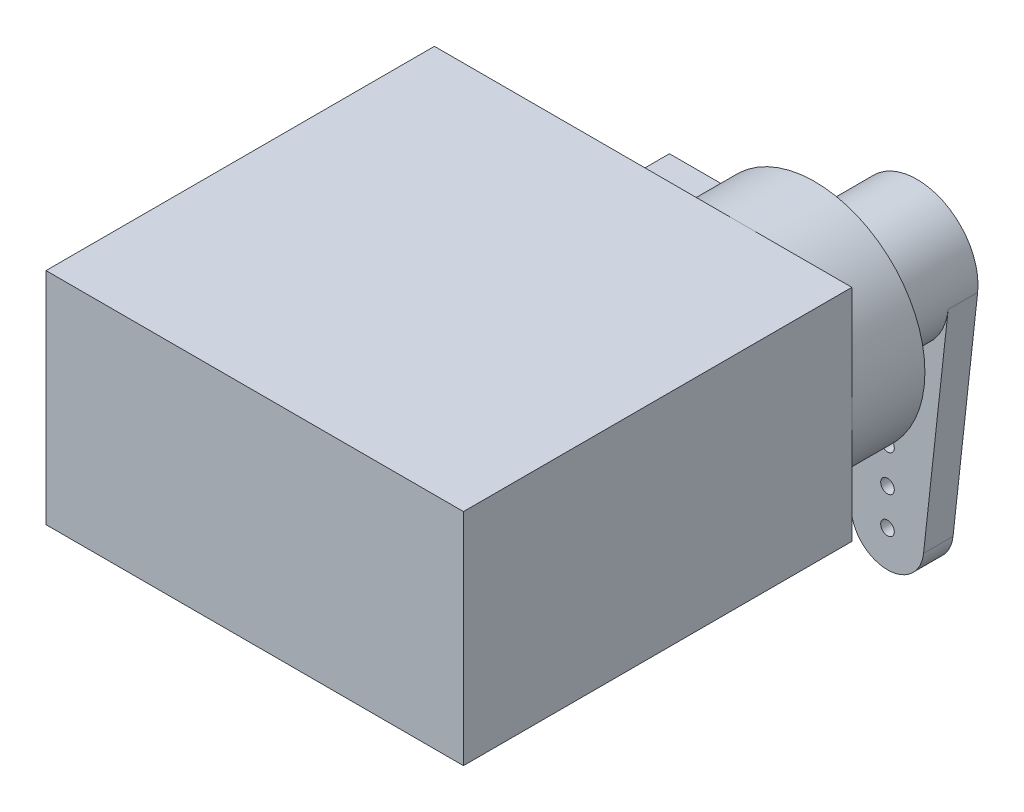
ISO-10303-21;
HEADER;
FILE_DESCRIPTION(('STEP AP214'),'2;1');
FILE_NAME('part.step','',(''),(''),'','','');
FILE_SCHEMA(('AUTOMOTIVE_DESIGN { 1 0 10303 214 1 1 1 1 }'));
ENDSEC;
DATA;
#1=APPLICATION_CONTEXT('core data for automotive mechanical design processes');
#2=APPLICATION_PROTOCOL_DEFINITION('international standard','automotive_design',2000,#1);
#3=PRODUCT_CONTEXT('',#1,'mechanical');
#4=PRODUCT('Part','Part','',(#3));
#5=PRODUCT_RELATED_PRODUCT_CATEGORY('part','',(#4));
#6=PRODUCT_DEFINITION_FORMATION('','',#4);
#7=PRODUCT_DEFINITION_CONTEXT('part definition',#1,'design');
#8=PRODUCT_DEFINITION('design','',#6,#7);
#9=PRODUCT_DEFINITION_SHAPE('','',#8);
#10=(LENGTH_UNIT() NAMED_UNIT(*) SI_UNIT(.MILLI.,.METRE.));
#11=(NAMED_UNIT(*) PLANE_ANGLE_UNIT() SI_UNIT($,.RADIAN.));
#12=(NAMED_UNIT(*) SI_UNIT($,.STERADIAN.) SOLID_ANGLE_UNIT());
#13=UNCERTAINTY_MEASURE_WITH_UNIT(LENGTH_MEASURE(1.E-05),#10,'distance_accuracy_value','');
#14=(GEOMETRIC_REPRESENTATION_CONTEXT(3) GLOBAL_UNCERTAINTY_ASSIGNED_CONTEXT((#13)) GLOBAL_UNIT_ASSIGNED_CONTEXT((#10,
#11,#12)) REPRESENTATION_CONTEXT('',''));
#15=CARTESIAN_POINT('',(0.,0.,0.));
#16=DIRECTION('',(0.,0.,1.));
#17=DIRECTION('',(1.,0.,0.));
#18=AXIS2_PLACEMENT_3D('',#15,#16,#17);
#19=CARTESIAN_POINT('',(-11.684,12.319,-10.8712));
#20=DIRECTION('',(0.,0.,1.));
#21=DIRECTION('',(1.,0.,0.));
#22=AXIS2_PLACEMENT_3D('',#19,#20,#21);
#23=PLANE('',#22);
#24=CARTESIAN_POINT('',(5.5245,6.1595,-10.8712));
#25=DIRECTION('',(0.,0.,-1.));
#26=DIRECTION('',(-1.,0.,0.));
#27=AXIS2_PLACEMENT_3D('',#24,#25,#26);
#28=CIRCLE('',#27,6.1595);
#29=CARTESIAN_POINT('',(0.416257507713633,9.6012,-10.8712));
#30=VERTEX_POINT('',#29);
#31=CARTESIAN_POINT('',(5.5245,12.319,-10.8712));
#32=VERTEX_POINT('',#31);
#33=EDGE_CURVE('E43',#30,#32,#28,.T.);
#34=ORIENTED_EDGE('',*,*,#33,.F.);
#35=DIRECTION('',(1.,0.,0.));
#36=VECTOR('',#35,1.);
#37=CARTESIAN_POINT('',(0.416257507713633,9.6012,-10.8712));
#38=LINE('',#37,#36);
#39=CARTESIAN_POINT('',(-2.6162,9.6012,-10.8712));
#40=VERTEX_POINT('',#39);
#41=EDGE_CURVE('E170',#40,#30,#38,.T.);
#42=ORIENTED_EDGE('',*,*,#41,.F.);
#43=DIRECTION('',(0.,1.,0.));
#44=VECTOR('',#43,1.);
#45=CARTESIAN_POINT('',(-2.6162,2.7178,-10.8712));
#46=LINE('',#45,#44);
#47=CARTESIAN_POINT('',(-2.6162,2.7178,-10.8712));
#48=VERTEX_POINT('',#47);
#49=EDGE_CURVE('E181',#48,#40,#46,.T.);
#50=ORIENTED_EDGE('',*,*,#49,.F.);
#51=DIRECTION('',(-1.,0.,0.));
#52=VECTOR('',#51,1.);
#53=CARTESIAN_POINT('',(0.416257507713633,2.7178,-10.8712));
#54=LINE('',#53,#52);
#55=CARTESIAN_POINT('',(0.416257507713633,2.7178,-10.8712));
#56=VERTEX_POINT('',#55);
#57=EDGE_CURVE('E177',#56,#48,#54,.T.);
#58=ORIENTED_EDGE('',*,*,#57,.F.);
#59=CARTESIAN_POINT('',(5.5245,0.,-10.8712));
#60=VERTEX_POINT('',#59);
#61=EDGE_CURVE('E178',#60,#56,#28,.T.);
#62=ORIENTED_EDGE('',*,*,#61,.F.);
#63=DIRECTION('',(-1.,0.,0.));
#64=VECTOR('',#63,1.);
#65=CARTESIAN_POINT('',(-11.684,0.,-10.8712));
#66=LINE('',#65,#64);
#67=CARTESIAN_POINT('',(-11.684,0.,-10.8712));
#68=VERTEX_POINT('',#67);
#69=EDGE_CURVE('E212',#60,#68,#66,.T.);
#70=ORIENTED_EDGE('',*,*,#69,.T.);
#71=DIRECTION('',(0.,-1.,0.));
#72=VECTOR('',#71,1.);
#73=CARTESIAN_POINT('',(-11.684,12.319,-10.8712));
#74=LINE('',#73,#72);
#75=CARTESIAN_POINT('',(-11.684,12.319,-10.8712));
#76=VERTEX_POINT('',#75);
#77=EDGE_CURVE('E223',#76,#68,#74,.T.);
#78=ORIENTED_EDGE('',*,*,#77,.F.);
#79=DIRECTION('',(-1.,0.,0.));
#80=VECTOR('',#79,1.);
#81=CARTESIAN_POINT('',(-11.684,12.319,-10.8712));
#82=LINE('',#81,#80);
#83=EDGE_CURVE('E200',#32,#76,#82,.T.);
#84=ORIENTED_EDGE('',*,*,#83,.F.);
#85=EDGE_LOOP('',(#34,#42,#50,#58,#62,#70,#78,#84));
#86=FACE_BOUND('',#85,.T.);
#87=ADVANCED_FACE('F32',(#86),#23,.F.);
#88=CARTESIAN_POINT('',(11.684,6.1595,-10.8712));
#89=VERTEX_POINT('',#88);
#90=EDGE_CURVE('E11',#32,#89,#28,.T.);
#91=ORIENTED_EDGE('',*,*,#90,.F.);
#92=CARTESIAN_POINT('',(11.684,12.319,-10.8712));
#93=VERTEX_POINT('',#92);
#94=EDGE_CURVE('E202',#93,#32,#82,.T.);
#95=ORIENTED_EDGE('',*,*,#94,.F.);
#96=DIRECTION('',(0.,-1.,0.));
#97=VECTOR('',#96,1.);
#98=CARTESIAN_POINT('',(11.684,12.319,-10.8712));
#99=LINE('',#98,#97);
#100=EDGE_CURVE('E36',#93,#89,#99,.T.);
#101=ORIENTED_EDGE('',*,*,#100,.T.);
#102=EDGE_LOOP('',(#91,#95,#101));
#103=FACE_BOUND('',#102,.T.);
#104=ADVANCED_FACE('F274',(#103),#23,.F.);
#105=EDGE_CURVE('E41',#89,#60,#28,.T.);
#106=ORIENTED_EDGE('',*,*,#105,.F.);
#107=CARTESIAN_POINT('',(11.684,0.,-10.8712));
#108=VERTEX_POINT('',#107);
#109=EDGE_CURVE('E225',#89,#108,#99,.T.);
#110=ORIENTED_EDGE('',*,*,#109,.T.);
#111=EDGE_CURVE('E213',#108,#60,#66,.T.);
#112=ORIENTED_EDGE('',*,*,#111,.T.);
#113=EDGE_LOOP('',(#106,#110,#112));
#114=FACE_BOUND('',#113,.T.);
#115=ADVANCED_FACE('F241',(#114),#23,.F.);
#116=CARTESIAN_POINT('',(11.684,12.319,-10.8712));
#117=DIRECTION('',(-1.,0.,0.));
#118=DIRECTION('',(0.,0.,1.));
#119=AXIS2_PLACEMENT_3D('',#116,#117,#118);
#120=PLANE('',#119);
#121=DIRECTION('',(0.,0.,-1.));
#122=VECTOR('',#121,1.);
#123=CARTESIAN_POINT('',(11.684,0.,-10.8712));
#124=LINE('',#123,#122);
#125=CARTESIAN_POINT('',(11.684,0.,10.8712));
#126=VERTEX_POINT('',#125);
#127=EDGE_CURVE('E196',#126,#108,#124,.T.);
#128=ORIENTED_EDGE('',*,*,#127,.T.);
#129=ORIENTED_EDGE('',*,*,#109,.F.);
#130=ORIENTED_EDGE('',*,*,#100,.F.);
#131=DIRECTION('',(0.,0.,-1.));
#132=VECTOR('',#131,1.);
#133=CARTESIAN_POINT('',(11.684,12.319,-10.8712));
#134=LINE('',#133,#132);
#135=CARTESIAN_POINT('',(11.684,12.319,10.8712));
#136=VERTEX_POINT('',#135);
#137=EDGE_CURVE('E197',#136,#93,#134,.T.);
#138=ORIENTED_EDGE('',*,*,#137,.F.);
#139=DIRECTION('',(0.,-1.,0.));
#140=VECTOR('',#139,1.);
#141=CARTESIAN_POINT('',(11.684,12.319,10.8712));
#142=LINE('',#141,#140);
#143=EDGE_CURVE('E209',#136,#126,#142,.T.);
#144=ORIENTED_EDGE('',*,*,#143,.T.);
#145=EDGE_LOOP('',(#128,#129,#130,#138,#144));
#146=FACE_BOUND('',#145,.T.);
#147=ADVANCED_FACE('F34',(#146),#120,.F.);
#148=CARTESIAN_POINT('',(-11.684,12.319,-10.8712));
#149=DIRECTION('',(1.,0.,0.));
#150=DIRECTION('',(0.,0.,-1.));
#151=AXIS2_PLACEMENT_3D('',#148,#149,#150);
#152=PLANE('',#151);
#153=DIRECTION('',(0.,0.,1.));
#154=VECTOR('',#153,1.);
#155=CARTESIAN_POINT('',(-11.684,0.,-10.8712));
#156=LINE('',#155,#154);
#157=CARTESIAN_POINT('',(-11.684,0.,10.8712));
#158=VERTEX_POINT('',#157);
#159=EDGE_CURVE('E216',#68,#158,#156,.T.);
#160=ORIENTED_EDGE('',*,*,#159,.T.);
#161=DIRECTION('',(0.,-1.,0.));
#162=VECTOR('',#161,1.);
#163=CARTESIAN_POINT('',(-11.684,12.319,10.8712));
#164=LINE('',#163,#162);
#165=CARTESIAN_POINT('',(-11.684,12.319,10.8712));
#166=VERTEX_POINT('',#165);
#167=EDGE_CURVE('E221',#166,#158,#164,.T.);
#168=ORIENTED_EDGE('',*,*,#167,.F.);
#169=DIRECTION('',(0.,0.,1.));
#170=VECTOR('',#169,1.);
#171=CARTESIAN_POINT('',(-11.684,12.319,-10.8712));
#172=LINE('',#171,#170);
#173=EDGE_CURVE('E205',#76,#166,#172,.T.);
#174=ORIENTED_EDGE('',*,*,#173,.F.);
#175=ORIENTED_EDGE('',*,*,#77,.T.);
#176=EDGE_LOOP('',(#160,#168,#174,#175));
#177=FACE_BOUND('',#176,.T.);
#178=ADVANCED_FACE('F283',(#177),#152,.F.);
#179=CARTESIAN_POINT('',(-11.684,12.319,10.8712));
#180=DIRECTION('',(0.,0.,-1.));
#181=DIRECTION('',(-1.,0.,0.));
#182=AXIS2_PLACEMENT_3D('',#179,#180,#181);
#183=PLANE('',#182);
#184=DIRECTION('',(1.,0.,0.));
#185=VECTOR('',#184,1.);
#186=CARTESIAN_POINT('',(-11.684,0.,10.8712));
#187=LINE('',#186,#185);
#188=EDGE_CURVE('E201',#158,#126,#187,.T.);
#189=ORIENTED_EDGE('',*,*,#188,.T.);
#190=ORIENTED_EDGE('',*,*,#143,.F.);
#191=DIRECTION('',(1.,0.,0.));
#192=VECTOR('',#191,1.);
#193=CARTESIAN_POINT('',(-11.684,12.319,10.8712));
#194=LINE('',#193,#192);
#195=EDGE_CURVE('E207',#166,#136,#194,.T.);
#196=ORIENTED_EDGE('',*,*,#195,.F.);
#197=ORIENTED_EDGE('',*,*,#167,.T.);
#198=EDGE_LOOP('',(#189,#190,#196,#197));
#199=FACE_BOUND('',#198,.T.);
#200=ADVANCED_FACE('F287',(#199),#183,.F.);
#201=CARTESIAN_POINT('',(0.,12.319,0.));
#202=DIRECTION('',(0.,1.,0.));
#203=DIRECTION('',(0.,0.,1.));
#204=AXIS2_PLACEMENT_3D('',#201,#202,#203);
#205=PLANE('',#204);
#206=ORIENTED_EDGE('',*,*,#137,.T.);
#207=ORIENTED_EDGE('',*,*,#94,.T.);
#208=ORIENTED_EDGE('',*,*,#83,.T.);
#209=ORIENTED_EDGE('',*,*,#173,.T.);
#210=ORIENTED_EDGE('',*,*,#195,.T.);
#211=EDGE_LOOP('',(#206,#207,#208,#209,#210));
#212=FACE_BOUND('',#211,.T.);
#213=ADVANCED_FACE('F291',(#212),#205,.T.);
#214=CARTESIAN_POINT('',(0.,0.,0.));
#215=DIRECTION('',(0.,1.,0.));
#216=DIRECTION('',(0.,0.,1.));
#217=AXIS2_PLACEMENT_3D('',#214,#215,#216);
#218=PLANE('',#217);
#219=ORIENTED_EDGE('',*,*,#127,.F.);
#220=ORIENTED_EDGE('',*,*,#188,.F.);
#221=ORIENTED_EDGE('',*,*,#159,.F.);
#222=ORIENTED_EDGE('',*,*,#69,.F.);
#223=ORIENTED_EDGE('',*,*,#111,.F.);
#224=EDGE_LOOP('',(#219,#220,#221,#222,#223));
#225=FACE_BOUND('',#224,.T.);
#226=ADVANCED_FACE('F248',(#225),#218,.F.);
#227=CARTESIAN_POINT('',(5.5245,6.1595,-14.9606));
#228=DIRECTION('',(0.,0.,1.));
#229=DIRECTION('',(1.,0.,0.));
#230=AXIS2_PLACEMENT_3D('',#227,#228,#229);
#231=CYLINDRICAL_SURFACE('',#230,6.1595);
#232=ORIENTED_EDGE('',*,*,#33,.T.);
#233=ORIENTED_EDGE('',*,*,#90,.T.);
#234=ORIENTED_EDGE('',*,*,#105,.T.);
#235=ORIENTED_EDGE('',*,*,#61,.T.);
#236=DIRECTION('',(0.,0.,1.));
#237=VECTOR('',#236,1.);
#238=CARTESIAN_POINT('',(0.416257507713633,2.7178,-14.9606));
#239=LINE('',#238,#237);
#240=CARTESIAN_POINT('',(0.416257507713633,2.7178,-14.9606));
#241=VERTEX_POINT('',#240);
#242=EDGE_CURVE('E193',#241,#56,#239,.T.);
#243=ORIENTED_EDGE('',*,*,#242,.F.);
#244=CARTESIAN_POINT('',(5.5245,6.1595,-14.9606));
#245=DIRECTION('',(0.,0.,-1.));
#246=DIRECTION('',(-1.,0.,0.));
#247=AXIS2_PLACEMENT_3D('',#244,#245,#246);
#248=CIRCLE('',#247,6.1595);
#249=CARTESIAN_POINT('',(0.416257507713633,9.6012,-14.9606));
#250=VERTEX_POINT('',#249);
#251=EDGE_CURVE('E166',#250,#241,#248,.T.);
#252=ORIENTED_EDGE('',*,*,#251,.F.);
#253=DIRECTION('',(0.,0.,1.));
#254=VECTOR('',#253,1.);
#255=CARTESIAN_POINT('',(0.416257507713633,9.6012,-14.9606));
#256=LINE('',#255,#254);
#257=EDGE_CURVE('E175',#250,#30,#256,.T.);
#258=ORIENTED_EDGE('',*,*,#257,.T.);
#259=EDGE_LOOP('',(#232,#233,#234,#235,#243,#252,#258));
#260=FACE_BOUND('',#259,.T.);
#261=ADVANCED_FACE('F240',(#260),#231,.T.);
#262=CARTESIAN_POINT('',(0.416257507713633,2.7178,-14.9606));
#263=DIRECTION('',(0.,1.,0.));
#264=DIRECTION('',(0.,0.,1.));
#265=AXIS2_PLACEMENT_3D('',#262,#263,#264);
#266=PLANE('',#265);
#267=ORIENTED_EDGE('',*,*,#57,.T.);
#268=DIRECTION('',(0.,0.,1.));
#269=VECTOR('',#268,1.);
#270=CARTESIAN_POINT('',(-2.6162,2.7178,-14.9606));
#271=LINE('',#270,#269);
#272=CARTESIAN_POINT('',(-2.6162,2.7178,-14.9606));
#273=VERTEX_POINT('',#272);
#274=EDGE_CURVE('E190',#273,#48,#271,.T.);
#275=ORIENTED_EDGE('',*,*,#274,.F.);
#276=DIRECTION('',(-1.,0.,0.));
#277=VECTOR('',#276,1.);
#278=CARTESIAN_POINT('',(0.416257507713633,2.7178,-14.9606));
#279=LINE('',#278,#277);
#280=EDGE_CURVE('E169',#241,#273,#279,.T.);
#281=ORIENTED_EDGE('',*,*,#280,.F.);
#282=ORIENTED_EDGE('',*,*,#242,.T.);
#283=EDGE_LOOP('',(#267,#275,#281,#282));
#284=FACE_BOUND('',#283,.T.);
#285=ADVANCED_FACE('F252',(#284),#266,.F.);
#286=CARTESIAN_POINT('',(-2.6162,2.7178,-14.9606));
#287=DIRECTION('',(1.,0.,0.));
#288=DIRECTION('',(0.,0.,-1.));
#289=AXIS2_PLACEMENT_3D('',#286,#287,#288);
#290=PLANE('',#289);
#291=ORIENTED_EDGE('',*,*,#49,.T.);
#292=DIRECTION('',(0.,0.,1.));
#293=VECTOR('',#292,1.);
#294=CARTESIAN_POINT('',(-2.6162,9.6012,-14.9606));
#295=LINE('',#294,#293);
#296=CARTESIAN_POINT('',(-2.6162,9.6012,-14.9606));
#297=VERTEX_POINT('',#296);
#298=EDGE_CURVE('E187',#297,#40,#295,.T.);
#299=ORIENTED_EDGE('',*,*,#298,.F.);
#300=DIRECTION('',(0.,1.,0.));
#301=VECTOR('',#300,1.);
#302=CARTESIAN_POINT('',(-2.6162,2.7178,-14.9606));
#303=LINE('',#302,#301);
#304=EDGE_CURVE('E172',#273,#297,#303,.T.);
#305=ORIENTED_EDGE('',*,*,#304,.F.);
#306=ORIENTED_EDGE('',*,*,#274,.T.);
#307=EDGE_LOOP('',(#291,#299,#305,#306));
#308=FACE_BOUND('',#307,.T.);
#309=ADVANCED_FACE('F255',(#308),#290,.F.);
#310=CARTESIAN_POINT('',(0.416257507713633,9.6012,-14.9606));
#311=DIRECTION('',(0.,-1.,0.));
#312=DIRECTION('',(0.,0.,-1.));
#313=AXIS2_PLACEMENT_3D('',#310,#311,#312);
#314=PLANE('',#313);
#315=ORIENTED_EDGE('',*,*,#41,.T.);
#316=ORIENTED_EDGE('',*,*,#257,.F.);
#317=DIRECTION('',(1.,0.,0.));
#318=VECTOR('',#317,1.);
#319=CARTESIAN_POINT('',(0.416257507713633,9.6012,-14.9606));
#320=LINE('',#319,#318);
#321=EDGE_CURVE('E174',#297,#250,#320,.T.);
#322=ORIENTED_EDGE('',*,*,#321,.F.);
#323=ORIENTED_EDGE('',*,*,#298,.T.);
#324=EDGE_LOOP('',(#315,#316,#322,#323));
#325=FACE_BOUND('',#324,.T.);
#326=ADVANCED_FACE('F263',(#325),#314,.F.);
#327=CARTESIAN_POINT('',(5.5245,6.1595,-14.9606));
#328=DIRECTION('',(0.,0.,-1.));
#329=DIRECTION('',(-1.,0.,0.));
#330=AXIS2_PLACEMENT_3D('',#327,#328,#329);
#331=PLANE('',#330);
#332=CARTESIAN_POINT('',(5.5245,6.1595,-14.9606));
#333=DIRECTION('',(0.,0.,-1.));
#334=DIRECTION('',(-1.,0.,0.));
#335=AXIS2_PLACEMENT_3D('',#332,#333,#334);
#336=CIRCLE('',#335,3.4163);
#337=CARTESIAN_POINT('',(2.1082,6.1595,-14.9606));
#338=VERTEX_POINT('',#337);
#339=EDGE_CURVE('E157',#338,#338,#336,.T.);
#340=ORIENTED_EDGE('',*,*,#339,.F.);
#341=EDGE_LOOP('',(#340));
#342=FACE_BOUND('',#341,.T.);
#343=ORIENTED_EDGE('',*,*,#251,.T.);
#344=ORIENTED_EDGE('',*,*,#280,.T.);
#345=ORIENTED_EDGE('',*,*,#304,.T.);
#346=ORIENTED_EDGE('',*,*,#321,.T.);
#347=EDGE_LOOP('',(#343,#344,#345,#346));
#348=FACE_BOUND('',#347,.T.);
#349=ADVANCED_FACE('F259',(#342,#348),#331,.T.);
#350=CARTESIAN_POINT('',(5.5245,6.1595,-19.0246));
#351=DIRECTION('',(0.,0.,1.));
#352=DIRECTION('',(1.,0.,0.));
#353=AXIS2_PLACEMENT_3D('',#350,#351,#352);
#354=CYLINDRICAL_SURFACE('',#353,3.4163);
#355=CARTESIAN_POINT('',(5.5245,6.1595,-19.0246));
#356=DIRECTION('',(0.,0.,-1.));
#357=DIRECTION('',(-1.,0.,0.));
#358=AXIS2_PLACEMENT_3D('',#355,#356,#357);
#359=CIRCLE('',#358,3.4163);
#360=CARTESIAN_POINT('',(8.92032177651975,5.78600280842528,-19.0246));
#361=VERTEX_POINT('',#360);
#362=CARTESIAN_POINT('',(2.12867822348024,5.78600280842528,-19.0246));
#363=VERTEX_POINT('',#362);
#364=EDGE_CURVE('E50',#361,#363,#359,.T.);
#365=ORIENTED_EDGE('',*,*,#364,.F.);
#366=DIRECTION('',(0.,0.,1.));
#367=VECTOR('',#366,1.);
#368=CARTESIAN_POINT('',(8.92032177651975,5.78600280842528,-20.6756));
#369=LINE('',#368,#367);
#370=CARTESIAN_POINT('',(8.92032177651975,5.78600280842528,-20.6756));
#371=VERTEX_POINT('',#370);
#372=EDGE_CURVE('E138',#371,#361,#369,.T.);
#373=ORIENTED_EDGE('',*,*,#372,.F.);
#374=CARTESIAN_POINT('',(5.5245,6.1595,-20.6756));
#375=DIRECTION('',(0.,0.,-1.));
#376=DIRECTION('',(-1.,0.,0.));
#377=AXIS2_PLACEMENT_3D('',#374,#375,#376);
#378=CIRCLE('',#377,3.4163);
#379=CARTESIAN_POINT('',(2.12867822348024,5.78600280842528,-20.6756));
#380=VERTEX_POINT('',#379);
#381=EDGE_CURVE('E144',#380,#371,#378,.T.);
#382=ORIENTED_EDGE('',*,*,#381,.F.);
#383=DIRECTION('',(0.,0.,1.));
#384=VECTOR('',#383,1.);
#385=CARTESIAN_POINT('',(2.12867822348024,5.78600280842528,-20.6756));
#386=LINE('',#385,#384);
#387=EDGE_CURVE('E468',#380,#363,#386,.T.);
#388=ORIENTED_EDGE('',*,*,#387,.T.);
#389=EDGE_LOOP('',(#365,#373,#382,#388));
#390=FACE_BOUND('',#389,.T.);
#391=ORIENTED_EDGE('',*,*,#339,.T.);
#392=EDGE_LOOP('',(#391));
#393=FACE_BOUND('',#392,.T.);
#394=ADVANCED_FACE('F155',(#390,#393),#354,.T.);
#395=CARTESIAN_POINT('',(5.5245,6.1595,-19.0246));
#396=DIRECTION('',(0.,0.,-1.));
#397=DIRECTION('',(-1.,0.,0.));
#398=AXIS2_PLACEMENT_3D('',#395,#396,#397);
#399=PLANE('',#398);
#400=CARTESIAN_POINT('',(5.5245,-4.4704,-19.0246));
#401=DIRECTION('',(0.,0.,-1.));
#402=DIRECTION('',(-1.,0.,0.));
#403=AXIS2_PLACEMENT_3D('',#400,#401,#402);
#404=CIRCLE('',#403,0.380999999999994);
#405=CARTESIAN_POINT('',(5.1435,-4.4704,-19.0246));
#406=VERTEX_POINT('',#405);
#407=EDGE_CURVE('E434',#406,#406,#404,.F.);
#408=ORIENTED_EDGE('',*,*,#407,.F.);
#409=EDGE_LOOP('',(#408));
#410=FACE_BOUND('',#409,.T.);
#411=CARTESIAN_POINT('',(5.52450000000001,-2.4384,-19.0246));
#412=DIRECTION('',(0.,0.,-1.));
#413=DIRECTION('',(-1.,0.,0.));
#414=AXIS2_PLACEMENT_3D('',#411,#412,#413);
#415=CIRCLE('',#414,0.381000000000001);
#416=CARTESIAN_POINT('',(5.14350000000001,-2.4384,-19.0246));
#417=VERTEX_POINT('',#416);
#418=EDGE_CURVE('E438',#417,#417,#415,.F.);
#419=ORIENTED_EDGE('',*,*,#418,.F.);
#420=EDGE_LOOP('',(#419));
#421=FACE_BOUND('',#420,.T.);
#422=CARTESIAN_POINT('',(5.52450000000002,-0.4064,-19.0246));
#423=DIRECTION('',(0.,0.,-1.));
#424=DIRECTION('',(-1.,0.,0.));
#425=AXIS2_PLACEMENT_3D('',#422,#423,#424);
#426=CIRCLE('',#425,0.381000000000001);
#427=CARTESIAN_POINT('',(5.14350000000002,-0.4064,-19.0246));
#428=VERTEX_POINT('',#427);
#429=EDGE_CURVE('E447',#428,#428,#426,.F.);
#430=ORIENTED_EDGE('',*,*,#429,.F.);
#431=EDGE_LOOP('',(#430));
#432=FACE_BOUND('',#431,.T.);
#433=CARTESIAN_POINT('',(5.52450000000002,1.6256,-19.0246));
#434=DIRECTION('',(0.,0.,-1.));
#435=DIRECTION('',(-1.,0.,0.));
#436=AXIS2_PLACEMENT_3D('',#433,#434,#435);
#437=CIRCLE('',#436,0.381000000000001);
#438=CARTESIAN_POINT('',(5.14350000000002,1.6256,-19.0246));
#439=VERTEX_POINT('',#438);
#440=EDGE_CURVE('E452',#439,#439,#437,.F.);
#441=ORIENTED_EDGE('',*,*,#440,.F.);
#442=EDGE_LOOP('',(#441));
#443=FACE_BOUND('',#442,.T.);
#444=CARTESIAN_POINT('',(5.5245,-6.5024,-19.0246));
#445=DIRECTION('',(0.,0.,-1.));
#446=DIRECTION('',(-1.,0.,0.));
#447=AXIS2_PLACEMENT_3D('',#444,#445,#446);
#448=CIRCLE('',#447,0.381000000000001);
#449=CARTESIAN_POINT('',(5.1435,-6.5024,-19.0246));
#450=VERTEX_POINT('',#449);
#451=EDGE_CURVE('E462',#450,#450,#448,.F.);
#452=ORIENTED_EDGE('',*,*,#451,.F.);
#453=EDGE_LOOP('',(#452));
#454=FACE_BOUND('',#453,.T.);
#455=DIRECTION('',(-0.109327983951856,-0.994005730328061,0.));
#456=VECTOR('',#455,1.);
#457=CARTESIAN_POINT('',(8.92032177651975,5.78600280842528,-19.0246));
#458=LINE('',#457,#456);
#459=CARTESIAN_POINT('',(7.54431964402661,-6.72455446339017,-19.0246));
#460=VERTEX_POINT('',#459);
#461=EDGE_CURVE('E464',#361,#460,#458,.T.);
#462=ORIENTED_EDGE('',*,*,#461,.F.);
#463=ORIENTED_EDGE('',*,*,#364,.T.);
#464=DIRECTION('',(-0.109327983951856,0.994005730328061,0.));
#465=VECTOR('',#464,1.);
#466=CARTESIAN_POINT('',(3.50468035597338,-6.72455446339017,-19.0246));
#467=LINE('',#466,#465);
#468=CARTESIAN_POINT('',(3.50468035597338,-6.72455446339017,-19.0246));
#469=VERTEX_POINT('',#468);
#470=EDGE_CURVE('E153',#469,#363,#467,.T.);
#471=ORIENTED_EDGE('',*,*,#470,.F.);
#472=CARTESIAN_POINT('',(5.5245,-6.5024,-19.0246));
#473=DIRECTION('',(0.,0.,-1.));
#474=DIRECTION('',(-1.,0.,0.));
#475=AXIS2_PLACEMENT_3D('',#472,#473,#474);
#476=CIRCLE('',#475,2.032);
#477=EDGE_CURVE('E470',#460,#469,#476,.T.);
#478=ORIENTED_EDGE('',*,*,#477,.F.);
#479=EDGE_LOOP('',(#462,#463,#471,#478));
#480=FACE_BOUND('',#479,.T.);
#481=ADVANCED_FACE('F331',(#410,#421,#432,#443,#454,#480),#399,.F.);
#482=CARTESIAN_POINT('',(8.92032177651975,5.78600280842528,-20.6756));
#483=DIRECTION('',(-0.994005730328061,0.109327983951856,0.));
#484=DIRECTION('',(-0.109327983951856,-0.994005730328061,0.));
#485=AXIS2_PLACEMENT_3D('',#482,#483,#484);
#486=PLANE('',#485);
#487=ORIENTED_EDGE('',*,*,#461,.T.);
#488=DIRECTION('',(0.,0.,1.));
#489=VECTOR('',#488,1.);
#490=CARTESIAN_POINT('',(7.54431964402661,-6.72455446339017,-20.6756));
#491=LINE('',#490,#489);
#492=CARTESIAN_POINT('',(7.54431964402661,-6.72455446339017,-20.6756));
#493=VERTEX_POINT('',#492);
#494=EDGE_CURVE('E140',#493,#460,#491,.T.);
#495=ORIENTED_EDGE('',*,*,#494,.F.);
#496=DIRECTION('',(-0.109327983951856,-0.994005730328061,0.));
#497=VECTOR('',#496,1.);
#498=CARTESIAN_POINT('',(8.92032177651975,5.78600280842528,-20.6756));
#499=LINE('',#498,#497);
#500=EDGE_CURVE('E134',#371,#493,#499,.T.);
#501=ORIENTED_EDGE('',*,*,#500,.F.);
#502=ORIENTED_EDGE('',*,*,#372,.T.);
#503=EDGE_LOOP('',(#487,#495,#501,#502));
#504=FACE_BOUND('',#503,.T.);
#505=ADVANCED_FACE('F136',(#504),#486,.F.);
#506=CARTESIAN_POINT('',(5.5245,-6.5024,-20.6756));
#507=DIRECTION('',(0.,0.,1.));
#508=DIRECTION('',(1.,0.,0.));
#509=AXIS2_PLACEMENT_3D('',#506,#507,#508);
#510=CYLINDRICAL_SURFACE('',#509,2.032);
#511=ORIENTED_EDGE('',*,*,#477,.T.);
#512=DIRECTION('',(0.,0.,1.));
#513=VECTOR('',#512,1.);
#514=CARTESIAN_POINT('',(3.50468035597338,-6.72455446339017,-20.6756));
#515=LINE('',#514,#513);
#516=CARTESIAN_POINT('',(3.50468035597338,-6.72455446339017,-20.6756));
#517=VERTEX_POINT('',#516);
#518=EDGE_CURVE('E161',#517,#469,#515,.T.);
#519=ORIENTED_EDGE('',*,*,#518,.F.);
#520=CARTESIAN_POINT('',(5.5245,-6.5024,-20.6756));
#521=DIRECTION('',(0.,0.,-1.));
#522=DIRECTION('',(-1.,0.,0.));
#523=AXIS2_PLACEMENT_3D('',#520,#521,#522);
#524=CIRCLE('',#523,2.032);
#525=EDGE_CURVE('E143',#493,#517,#524,.T.);
#526=ORIENTED_EDGE('',*,*,#525,.F.);
#527=ORIENTED_EDGE('',*,*,#494,.T.);
#528=EDGE_LOOP('',(#511,#519,#526,#527));
#529=FACE_BOUND('',#528,.T.);
#530=ADVANCED_FACE('F342',(#529),#510,.T.);
#531=CARTESIAN_POINT('',(3.50468035597338,-6.72455446339017,-20.6756));
#532=DIRECTION('',(0.994005730328061,0.109327983951856,0.));
#533=DIRECTION('',(-0.109327983951856,0.994005730328061,0.));
#534=AXIS2_PLACEMENT_3D('',#531,#532,#533);
#535=PLANE('',#534);
#536=ORIENTED_EDGE('',*,*,#470,.T.);
#537=ORIENTED_EDGE('',*,*,#387,.F.);
#538=DIRECTION('',(-0.109327983951856,0.994005730328061,0.));
#539=VECTOR('',#538,1.);
#540=CARTESIAN_POINT('',(3.50468035597338,-6.72455446339017,-20.6756));
#541=LINE('',#540,#539);
#542=EDGE_CURVE('E149',#517,#380,#541,.T.);
#543=ORIENTED_EDGE('',*,*,#542,.F.);
#544=ORIENTED_EDGE('',*,*,#518,.T.);
#545=EDGE_LOOP('',(#536,#537,#543,#544));
#546=FACE_BOUND('',#545,.T.);
#547=ADVANCED_FACE('F351',(#546),#535,.F.);
#548=CARTESIAN_POINT('',(5.5245,6.1595,-20.6756));
#549=DIRECTION('',(0.,0.,-1.));
#550=DIRECTION('',(-1.,0.,0.));
#551=AXIS2_PLACEMENT_3D('',#548,#549,#550);
#552=PLANE('',#551);
#553=CARTESIAN_POINT('',(5.5245,-4.4704,-20.6756));
#554=DIRECTION('',(0.,0.,-1.));
#555=DIRECTION('',(-1.,0.,0.));
#556=AXIS2_PLACEMENT_3D('',#553,#554,#555);
#557=CIRCLE('',#556,0.380999999999994);
#558=CARTESIAN_POINT('',(5.1435,-4.4704,-20.6756));
#559=VERTEX_POINT('',#558);
#560=EDGE_CURVE('E437',#559,#559,#557,.T.);
#561=ORIENTED_EDGE('',*,*,#560,.F.);
#562=EDGE_LOOP('',(#561));
#563=FACE_BOUND('',#562,.T.);
#564=CARTESIAN_POINT('',(5.52450000000001,-2.4384,-20.6756));
#565=DIRECTION('',(0.,0.,-1.));
#566=DIRECTION('',(-1.,0.,0.));
#567=AXIS2_PLACEMENT_3D('',#564,#565,#566);
#568=CIRCLE('',#567,0.381000000000001);
#569=CARTESIAN_POINT('',(5.14350000000001,-2.4384,-20.6756));
#570=VERTEX_POINT('',#569);
#571=EDGE_CURVE('E443',#570,#570,#568,.T.);
#572=ORIENTED_EDGE('',*,*,#571,.F.);
#573=EDGE_LOOP('',(#572));
#574=FACE_BOUND('',#573,.T.);
#575=CARTESIAN_POINT('',(5.52450000000002,-0.4064,-20.6756));
#576=DIRECTION('',(0.,0.,-1.));
#577=DIRECTION('',(-1.,0.,0.));
#578=AXIS2_PLACEMENT_3D('',#575,#576,#577);
#579=CIRCLE('',#578,0.381000000000001);
#580=CARTESIAN_POINT('',(5.14350000000002,-0.4064,-20.6756));
#581=VERTEX_POINT('',#580);
#582=EDGE_CURVE('E449',#581,#581,#579,.T.);
#583=ORIENTED_EDGE('',*,*,#582,.F.);
#584=EDGE_LOOP('',(#583));
#585=FACE_BOUND('',#584,.T.);
#586=CARTESIAN_POINT('',(5.52450000000002,1.6256,-20.6756));
#587=DIRECTION('',(0.,0.,-1.));
#588=DIRECTION('',(-1.,0.,0.));
#589=AXIS2_PLACEMENT_3D('',#586,#587,#588);
#590=CIRCLE('',#589,0.381000000000001);
#591=CARTESIAN_POINT('',(5.14350000000002,1.6256,-20.6756));
#592=VERTEX_POINT('',#591);
#593=EDGE_CURVE('E455',#592,#592,#590,.T.);
#594=ORIENTED_EDGE('',*,*,#593,.F.);
#595=EDGE_LOOP('',(#594));
#596=FACE_BOUND('',#595,.T.);
#597=CARTESIAN_POINT('',(5.5245,-6.5024,-20.6756));
#598=DIRECTION('',(0.,0.,-1.));
#599=DIRECTION('',(-1.,0.,0.));
#600=AXIS2_PLACEMENT_3D('',#597,#598,#599);
#601=CIRCLE('',#600,0.381000000000001);
#602=CARTESIAN_POINT('',(5.1435,-6.5024,-20.6756));
#603=VERTEX_POINT('',#602);
#604=EDGE_CURVE('E440',#603,#603,#601,.T.);
#605=ORIENTED_EDGE('',*,*,#604,.F.);
#606=EDGE_LOOP('',(#605));
#607=FACE_BOUND('',#606,.T.);
#608=ORIENTED_EDGE('',*,*,#381,.T.);
#609=ORIENTED_EDGE('',*,*,#500,.T.);
#610=ORIENTED_EDGE('',*,*,#525,.T.);
#611=ORIENTED_EDGE('',*,*,#542,.T.);
#612=EDGE_LOOP('',(#608,#609,#610,#611));
#613=FACE_BOUND('',#612,.T.);
#614=ADVANCED_FACE('F147',(#563,#574,#585,#596,#607,#613),#552,.T.);
#615=CARTESIAN_POINT('',(5.5245,-6.5024,-17.9469692654717));
#616=DIRECTION('',(0.,0.,-1.));
#617=DIRECTION('',(-1.,0.,0.));
#618=AXIS2_PLACEMENT_3D('',#615,#616,#617);
#619=CYLINDRICAL_SURFACE('',#618,0.381000000000001);
#620=ORIENTED_EDGE('',*,*,#451,.T.);
#621=EDGE_LOOP('',(#620));
#622=FACE_BOUND('',#621,.T.);
#623=ORIENTED_EDGE('',*,*,#604,.T.);
#624=EDGE_LOOP('',(#623));
#625=FACE_BOUND('',#624,.T.);
#626=ADVANCED_FACE('F377',(#622,#625),#619,.F.);
#627=CARTESIAN_POINT('',(5.52450000000002,1.6256,-17.9469692654717));
#628=DIRECTION('',(0.,0.,-1.));
#629=DIRECTION('',(-1.,0.,0.));
#630=AXIS2_PLACEMENT_3D('',#627,#628,#629);
#631=CYLINDRICAL_SURFACE('',#630,0.381000000000001);
#632=ORIENTED_EDGE('',*,*,#440,.T.);
#633=EDGE_LOOP('',(#632));
#634=FACE_BOUND('',#633,.T.);
#635=ORIENTED_EDGE('',*,*,#593,.T.);
#636=EDGE_LOOP('',(#635));
#637=FACE_BOUND('',#636,.T.);
#638=ADVANCED_FACE('F387',(#634,#637),#631,.F.);
#639=CARTESIAN_POINT('',(5.52450000000002,-0.4064,-17.9469692654717));
#640=DIRECTION('',(0.,0.,-1.));
#641=DIRECTION('',(-1.,0.,0.));
#642=AXIS2_PLACEMENT_3D('',#639,#640,#641);
#643=CYLINDRICAL_SURFACE('',#642,0.381000000000001);
#644=ORIENTED_EDGE('',*,*,#429,.T.);
#645=EDGE_LOOP('',(#644));
#646=FACE_BOUND('',#645,.T.);
#647=ORIENTED_EDGE('',*,*,#582,.T.);
#648=EDGE_LOOP('',(#647));
#649=FACE_BOUND('',#648,.T.);
#650=ADVANCED_FACE('F397',(#646,#649),#643,.F.);
#651=CARTESIAN_POINT('',(5.52450000000001,-2.4384,-17.9469692654717));
#652=DIRECTION('',(0.,0.,-1.));
#653=DIRECTION('',(-1.,0.,0.));
#654=AXIS2_PLACEMENT_3D('',#651,#652,#653);
#655=CYLINDRICAL_SURFACE('',#654,0.381000000000001);
#656=ORIENTED_EDGE('',*,*,#418,.T.);
#657=EDGE_LOOP('',(#656));
#658=FACE_BOUND('',#657,.T.);
#659=ORIENTED_EDGE('',*,*,#571,.T.);
#660=EDGE_LOOP('',(#659));
#661=FACE_BOUND('',#660,.T.);
#662=ADVANCED_FACE('F407',(#658,#661),#655,.F.);
#663=CARTESIAN_POINT('',(5.5245,-4.4704,-17.9469692654717));
#664=DIRECTION('',(0.,0.,-1.));
#665=DIRECTION('',(-1.,0.,0.));
#666=AXIS2_PLACEMENT_3D('',#663,#664,#665);
#667=CYLINDRICAL_SURFACE('',#666,0.380999999999994);
#668=ORIENTED_EDGE('',*,*,#407,.T.);
#669=EDGE_LOOP('',(#668));
#670=FACE_BOUND('',#669,.T.);
#671=ORIENTED_EDGE('',*,*,#560,.T.);
#672=EDGE_LOOP('',(#671));
#673=FACE_BOUND('',#672,.T.);
#674=ADVANCED_FACE('F417',(#670,#673),#667,.F.);
#675=CLOSED_SHELL('',(#87,#104,#115,#147,#178,#200,#213,#226,#261,#285,#309,#326,#349,#394,#481,
#505,#530,#547,#614,#626,#638,#650,#662,#674));
#676=MANIFOLD_SOLID_BREP('B2',#675);
#677=ADVANCED_BREP_SHAPE_REPRESENTATION('',(#18,#676),#14);
#678=SHAPE_DEFINITION_REPRESENTATION(#9,#677);
ENDSEC;
END-ISO-10303-21;
